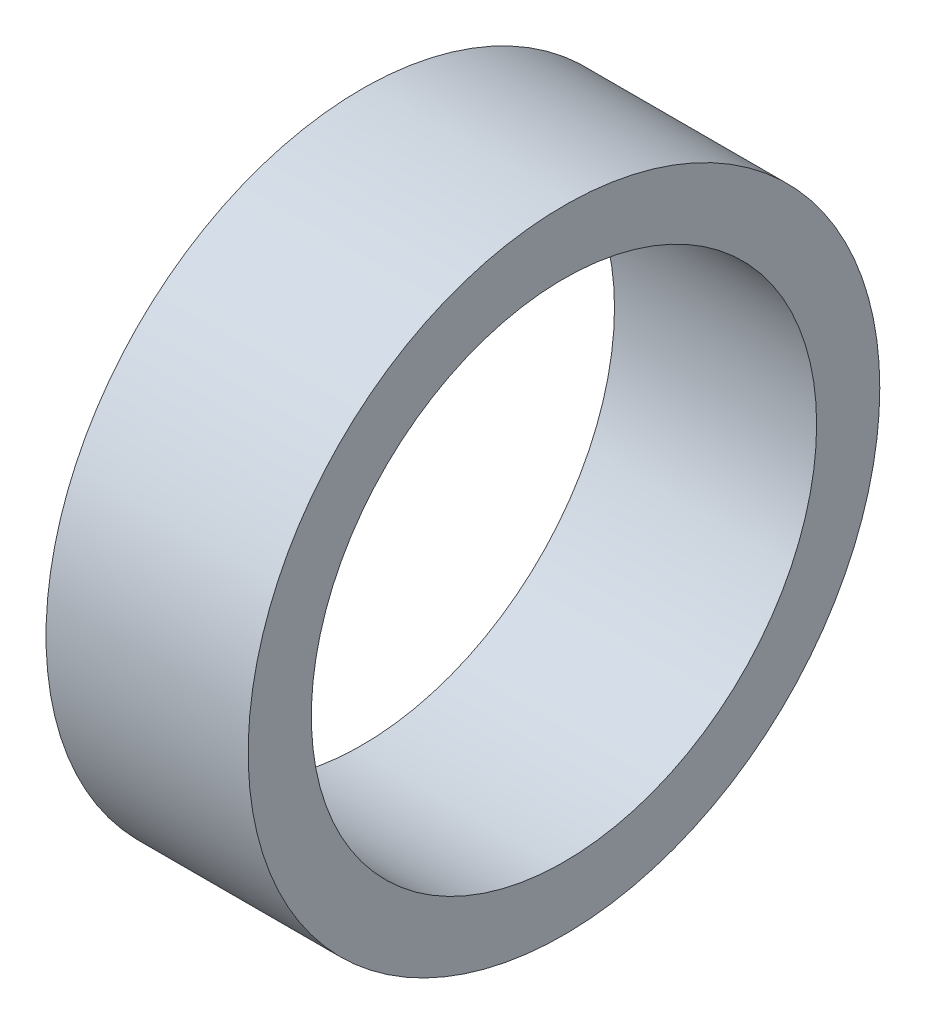
ISO-10303-21;
HEADER;
FILE_DESCRIPTION(('STEP AP214'),'2;1');
FILE_NAME('part.step','',(''),(''),'','','');
FILE_SCHEMA(('AUTOMOTIVE_DESIGN { 1 0 10303 214 1 1 1 1 }'));
ENDSEC;
DATA;
#1=APPLICATION_CONTEXT('core data for automotive mechanical design processes');
#2=APPLICATION_PROTOCOL_DEFINITION('international standard','automotive_design',2000,#1);
#3=PRODUCT_CONTEXT('',#1,'mechanical');
#4=PRODUCT('Part','Part','',(#3));
#5=PRODUCT_RELATED_PRODUCT_CATEGORY('part','',(#4));
#6=PRODUCT_DEFINITION_FORMATION('','',#4);
#7=PRODUCT_DEFINITION_CONTEXT('part definition',#1,'design');
#8=PRODUCT_DEFINITION('design','',#6,#7);
#9=PRODUCT_DEFINITION_SHAPE('','',#8);
#10=(LENGTH_UNIT() NAMED_UNIT(*) SI_UNIT(.MILLI.,.METRE.));
#11=(NAMED_UNIT(*) PLANE_ANGLE_UNIT() SI_UNIT($,.RADIAN.));
#12=(NAMED_UNIT(*) SI_UNIT($,.STERADIAN.) SOLID_ANGLE_UNIT());
#13=UNCERTAINTY_MEASURE_WITH_UNIT(LENGTH_MEASURE(1.E-05),#10,'distance_accuracy_value','');
#14=(GEOMETRIC_REPRESENTATION_CONTEXT(3) GLOBAL_UNCERTAINTY_ASSIGNED_CONTEXT((#13)) GLOBAL_UNIT_ASSIGNED_CONTEXT((#10,
#11,#12)) REPRESENTATION_CONTEXT('',''));
#15=CARTESIAN_POINT('',(0.,0.,0.));
#16=DIRECTION('',(0.,0.,1.));
#17=DIRECTION('',(1.,0.,0.));
#18=AXIS2_PLACEMENT_3D('',#15,#16,#17);
#19=CARTESIAN_POINT('',(8.,0.,0.));
#20=DIRECTION('',(1.,0.,0.));
#21=DIRECTION('',(0.,0.,-1.));
#22=AXIS2_PLACEMENT_3D('',#19,#20,#21);
#23=PLANE('',#22);
#24=CARTESIAN_POINT('',(8.,0.,0.));
#25=DIRECTION('',(1.,0.,0.));
#26=DIRECTION('',(0.,0.,-1.));
#27=AXIS2_PLACEMENT_3D('',#24,#25,#26);
#28=CIRCLE('',#27,12.5);
#29=CARTESIAN_POINT('',(8.,0.,-12.5));
#30=VERTEX_POINT('',#29);
#31=EDGE_CURVE('E10',#30,#30,#28,.T.);
#32=ORIENTED_EDGE('',*,*,#31,.T.);
#33=EDGE_LOOP('',(#32));
#34=FACE_BOUND('',#33,.T.);
#35=CARTESIAN_POINT('',(8.,0.,0.));
#36=DIRECTION('',(1.,0.,0.));
#37=DIRECTION('',(0.,0.,-1.));
#38=AXIS2_PLACEMENT_3D('',#35,#36,#37);
#39=CIRCLE('',#38,10.);
#40=CARTESIAN_POINT('',(8.,0.,-10.));
#41=VERTEX_POINT('',#40);
#42=EDGE_CURVE('E54',#41,#41,#39,.T.);
#43=ORIENTED_EDGE('',*,*,#42,.F.);
#44=EDGE_LOOP('',(#43));
#45=FACE_BOUND('',#44,.T.);
#46=ADVANCED_FACE('F41',(#34,#45),#23,.T.);
#47=CARTESIAN_POINT('',(0.,0.,0.));
#48=DIRECTION('',(1.,0.,0.));
#49=DIRECTION('',(0.,0.,-1.));
#50=AXIS2_PLACEMENT_3D('',#47,#48,#49);
#51=PLANE('',#50);
#52=CARTESIAN_POINT('',(0.,0.,0.));
#53=DIRECTION('',(1.,0.,0.));
#54=DIRECTION('',(0.,0.,-1.));
#55=AXIS2_PLACEMENT_3D('',#52,#53,#54);
#56=CIRCLE('',#55,12.5);
#57=CARTESIAN_POINT('',(0.,0.,-12.5));
#58=VERTEX_POINT('',#57);
#59=EDGE_CURVE('E45',#58,#58,#56,.T.);
#60=ORIENTED_EDGE('',*,*,#59,.F.);
#61=EDGE_LOOP('',(#60));
#62=FACE_BOUND('',#61,.T.);
#63=CARTESIAN_POINT('',(0.,0.,0.));
#64=DIRECTION('',(1.,0.,0.));
#65=DIRECTION('',(0.,0.,-1.));
#66=AXIS2_PLACEMENT_3D('',#63,#64,#65);
#67=CIRCLE('',#66,10.);
#68=CARTESIAN_POINT('',(0.,0.,-10.));
#69=VERTEX_POINT('',#68);
#70=EDGE_CURVE('E56',#69,#69,#67,.T.);
#71=ORIENTED_EDGE('',*,*,#70,.T.);
#72=EDGE_LOOP('',(#71));
#73=FACE_BOUND('',#72,.T.);
#74=ADVANCED_FACE('F68',(#62,#73),#51,.F.);
#75=CARTESIAN_POINT('',(8.,0.,0.));
#76=DIRECTION('',(-1.,0.,0.));
#77=DIRECTION('',(0.,0.,1.));
#78=AXIS2_PLACEMENT_3D('',#75,#76,#77);
#79=CYLINDRICAL_SURFACE('',#78,12.5);
#80=ORIENTED_EDGE('',*,*,#31,.F.);
#81=EDGE_LOOP('',(#80));
#82=FACE_BOUND('',#81,.T.);
#83=ORIENTED_EDGE('',*,*,#59,.T.);
#84=EDGE_LOOP('',(#83));
#85=FACE_BOUND('',#84,.T.);
#86=ADVANCED_FACE('F43',(#82,#85),#79,.T.);
#87=CARTESIAN_POINT('',(8.,0.,0.));
#88=DIRECTION('',(-1.,0.,0.));
#89=DIRECTION('',(0.,0.,1.));
#90=AXIS2_PLACEMENT_3D('',#87,#88,#89);
#91=CYLINDRICAL_SURFACE('',#90,10.);
#92=ORIENTED_EDGE('',*,*,#42,.T.);
#93=EDGE_LOOP('',(#92));
#94=FACE_BOUND('',#93,.T.);
#95=ORIENTED_EDGE('',*,*,#70,.F.);
#96=EDGE_LOOP('',(#95));
#97=FACE_BOUND('',#96,.T.);
#98=ADVANCED_FACE('F64',(#94,#97),#91,.F.);
#99=CLOSED_SHELL('',(#46,#74,#86,#98));
#100=MANIFOLD_SOLID_BREP('B2',#99);
#101=ADVANCED_BREP_SHAPE_REPRESENTATION('',(#18,#100),#14);
#102=SHAPE_DEFINITION_REPRESENTATION(#9,#101);
ENDSEC;
END-ISO-10303-21;
